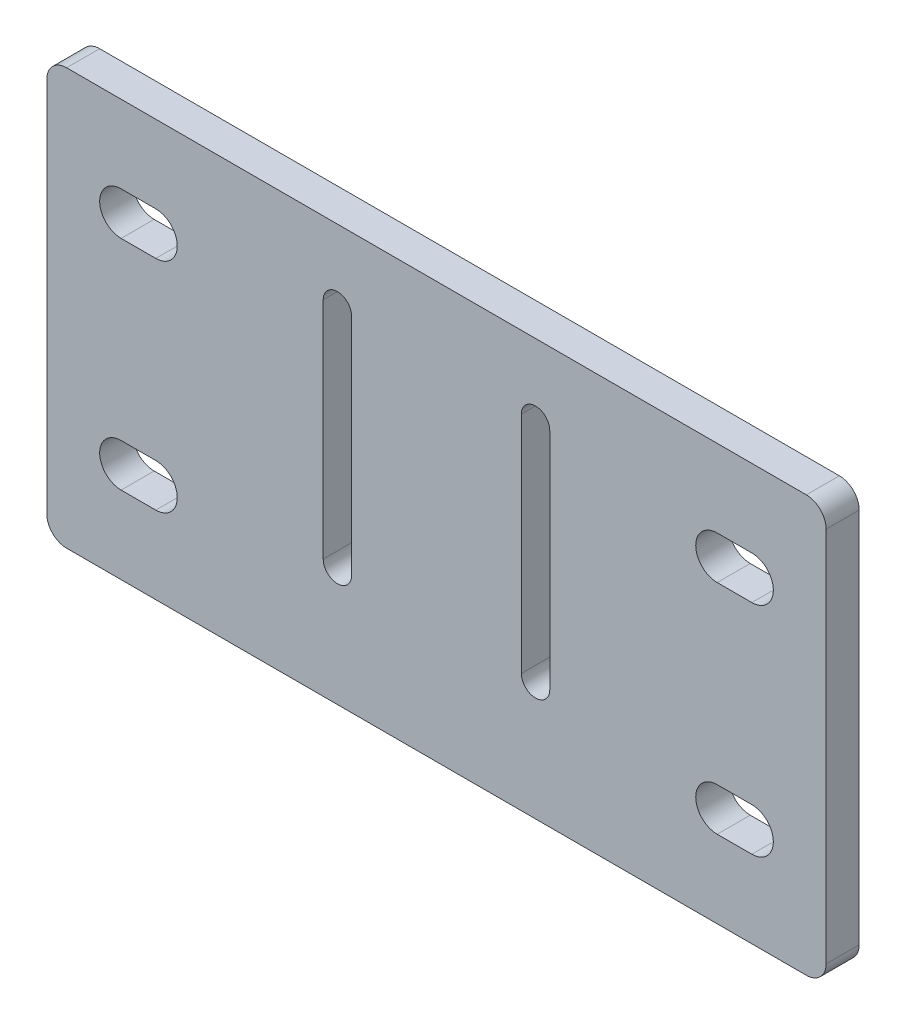
ISO-10303-21;
HEADER;
FILE_DESCRIPTION(('STEP AP214'),'2;1');
FILE_NAME('part.step','',(''),(''),'','','');
FILE_SCHEMA(('AUTOMOTIVE_DESIGN { 1 0 10303 214 1 1 1 1 }'));
ENDSEC;
DATA;
#1=APPLICATION_CONTEXT('core data for automotive mechanical design processes');
#2=APPLICATION_PROTOCOL_DEFINITION('international standard','automotive_design',2000,#1);
#3=PRODUCT_CONTEXT('',#1,'mechanical');
#4=PRODUCT('Part','Part','',(#3));
#5=PRODUCT_RELATED_PRODUCT_CATEGORY('part','',(#4));
#6=PRODUCT_DEFINITION_FORMATION('','',#4);
#7=PRODUCT_DEFINITION_CONTEXT('part definition',#1,'design');
#8=PRODUCT_DEFINITION('design','',#6,#7);
#9=PRODUCT_DEFINITION_SHAPE('','',#8);
#10=(LENGTH_UNIT() NAMED_UNIT(*) SI_UNIT(.MILLI.,.METRE.));
#11=(NAMED_UNIT(*) PLANE_ANGLE_UNIT() SI_UNIT($,.RADIAN.));
#12=(NAMED_UNIT(*) SI_UNIT($,.STERADIAN.) SOLID_ANGLE_UNIT());
#13=UNCERTAINTY_MEASURE_WITH_UNIT(LENGTH_MEASURE(1.E-05),#10,'distance_accuracy_value','');
#14=(GEOMETRIC_REPRESENTATION_CONTEXT(3) GLOBAL_UNCERTAINTY_ASSIGNED_CONTEXT((#13)) GLOBAL_UNIT_ASSIGNED_CONTEXT((#10,
#11,#12)) REPRESENTATION_CONTEXT('',''));
#15=CARTESIAN_POINT('',(0.,0.,0.));
#16=DIRECTION('',(0.,0.,1.));
#17=DIRECTION('',(1.,0.,0.));
#18=AXIS2_PLACEMENT_3D('',#15,#16,#17);
#19=CARTESIAN_POINT('',(56.,25.,5.));
#20=DIRECTION('',(0.,0.,1.));
#21=DIRECTION('',(1.,0.,0.));
#22=AXIS2_PLACEMENT_3D('',#19,#20,#21);
#23=PLANE('',#22);
#24=CARTESIAN_POINT('',(-47.7499999999999,-20.,5.));
#25=DIRECTION('',(0.,0.,1.));
#26=DIRECTION('',(-1.,0.,0.));
#27=AXIS2_PLACEMENT_3D('',#24,#25,#26);
#28=CIRCLE('',#27,3.25);
#29=CARTESIAN_POINT('',(-47.7499999999999,-16.75,5.));
#30=VERTEX_POINT('',#29);
#31=CARTESIAN_POINT('',(-47.7499999999999,-23.25,5.));
#32=VERTEX_POINT('',#31);
#33=EDGE_CURVE('E52',#30,#32,#28,.T.);
#34=ORIENTED_EDGE('',*,*,#33,.F.);
#35=DIRECTION('',(-1.,0.,0.));
#36=VECTOR('',#35,1.);
#37=CARTESIAN_POINT('',(-47.7499999999999,-16.75,5.));
#38=LINE('',#37,#36);
#39=CARTESIAN_POINT('',(-42.5,-16.75,5.));
#40=VERTEX_POINT('',#39);
#41=EDGE_CURVE('E269',#40,#30,#38,.T.);
#42=ORIENTED_EDGE('',*,*,#41,.F.);
#43=CARTESIAN_POINT('',(-42.5,-20.,5.));
#44=DIRECTION('',(0.,0.,1.));
#45=DIRECTION('',(-1.,0.,0.));
#46=AXIS2_PLACEMENT_3D('',#43,#44,#45);
#47=CIRCLE('',#46,3.25000000000001);
#48=CARTESIAN_POINT('',(-42.5,-23.25,5.));
#49=VERTEX_POINT('',#48);
#50=EDGE_CURVE('E253',#49,#40,#47,.T.);
#51=ORIENTED_EDGE('',*,*,#50,.F.);
#52=DIRECTION('',(1.,0.,0.));
#53=VECTOR('',#52,1.);
#54=CARTESIAN_POINT('',(-47.7499999999999,-23.25,5.));
#55=LINE('',#54,#53);
#56=EDGE_CURVE('E263',#32,#49,#55,.T.);
#57=ORIENTED_EDGE('',*,*,#56,.F.);
#58=EDGE_LOOP('',(#34,#42,#51,#57));
#59=FACE_BOUND('',#58,.T.);
#60=CARTESIAN_POINT('',(47.7499999999999,13.,5.));
#61=DIRECTION('',(0.,0.,1.));
#62=DIRECTION('',(-1.,0.,0.));
#63=AXIS2_PLACEMENT_3D('',#60,#61,#62);
#64=CIRCLE('',#63,3.25);
#65=CARTESIAN_POINT('',(47.7499999999999,9.74999999999999,5.));
#66=VERTEX_POINT('',#65);
#67=CARTESIAN_POINT('',(47.7499999999999,16.25,5.));
#68=VERTEX_POINT('',#67);
#69=EDGE_CURVE('E60',#66,#68,#64,.T.);
#70=ORIENTED_EDGE('',*,*,#69,.F.);
#71=DIRECTION('',(1.,0.,0.));
#72=VECTOR('',#71,1.);
#73=CARTESIAN_POINT('',(47.7499999999999,9.74999999999999,5.));
#74=LINE('',#73,#72);
#75=CARTESIAN_POINT('',(42.5,9.74999999999998,5.));
#76=VERTEX_POINT('',#75);
#77=EDGE_CURVE('E287',#76,#66,#74,.T.);
#78=ORIENTED_EDGE('',*,*,#77,.F.);
#79=CARTESIAN_POINT('',(42.5,13.,5.));
#80=DIRECTION('',(0.,0.,1.));
#81=DIRECTION('',(-1.,0.,0.));
#82=AXIS2_PLACEMENT_3D('',#79,#80,#81);
#83=CIRCLE('',#82,3.25000000000001);
#84=CARTESIAN_POINT('',(42.5,16.25,5.));
#85=VERTEX_POINT('',#84);
#86=EDGE_CURVE('E284',#85,#76,#83,.T.);
#87=ORIENTED_EDGE('',*,*,#86,.F.);
#88=DIRECTION('',(-1.,0.,0.));
#89=VECTOR('',#88,1.);
#90=CARTESIAN_POINT('',(47.7499999999999,16.25,5.));
#91=LINE('',#90,#89);
#92=EDGE_CURVE('E280',#68,#85,#91,.T.);
#93=ORIENTED_EDGE('',*,*,#92,.F.);
#94=EDGE_LOOP('',(#70,#78,#87,#93));
#95=FACE_BOUND('',#94,.T.);
#96=CARTESIAN_POINT('',(47.7499999999999,-20.,5.));
#97=DIRECTION('',(0.,0.,1.));
#98=DIRECTION('',(1.,0.,0.));
#99=AXIS2_PLACEMENT_3D('',#96,#97,#98);
#100=CIRCLE('',#99,3.25);
#101=CARTESIAN_POINT('',(47.7499999999999,-23.25,5.));
#102=VERTEX_POINT('',#101);
#103=CARTESIAN_POINT('',(47.7499999999999,-16.75,5.));
#104=VERTEX_POINT('',#103);
#105=EDGE_CURVE('E298',#102,#104,#100,.T.);
#106=ORIENTED_EDGE('',*,*,#105,.F.);
#107=DIRECTION('',(1.,0.,0.));
#108=VECTOR('',#107,1.);
#109=CARTESIAN_POINT('',(47.7499999999999,-23.25,5.));
#110=LINE('',#109,#108);
#111=CARTESIAN_POINT('',(42.5,-23.25,5.));
#112=VERTEX_POINT('',#111);
#113=EDGE_CURVE('E306',#112,#102,#110,.T.);
#114=ORIENTED_EDGE('',*,*,#113,.F.);
#115=CARTESIAN_POINT('',(42.5,-20.,5.));
#116=DIRECTION('',(0.,0.,1.));
#117=DIRECTION('',(1.,0.,0.));
#118=AXIS2_PLACEMENT_3D('',#115,#116,#117);
#119=CIRCLE('',#118,3.25000000000001);
#120=CARTESIAN_POINT('',(42.5,-16.75,5.));
#121=VERTEX_POINT('',#120);
#122=EDGE_CURVE('E303',#121,#112,#119,.T.);
#123=ORIENTED_EDGE('',*,*,#122,.F.);
#124=DIRECTION('',(-1.,0.,0.));
#125=VECTOR('',#124,1.);
#126=CARTESIAN_POINT('',(47.7499999999999,-16.75,5.));
#127=LINE('',#126,#125);
#128=EDGE_CURVE('E300',#104,#121,#127,.T.);
#129=ORIENTED_EDGE('',*,*,#128,.F.);
#130=EDGE_LOOP('',(#106,#114,#123,#129));
#131=FACE_BOUND('',#130,.T.);
#132=CARTESIAN_POINT('',(-47.7499999999999,13.,5.));
#133=DIRECTION('',(0.,0.,1.));
#134=DIRECTION('',(1.,0.,0.));
#135=AXIS2_PLACEMENT_3D('',#132,#133,#134);
#136=CIRCLE('',#135,3.25);
#137=CARTESIAN_POINT('',(-47.7499999999999,16.25,5.));
#138=VERTEX_POINT('',#137);
#139=CARTESIAN_POINT('',(-47.7499999999999,9.74999999999999,5.));
#140=VERTEX_POINT('',#139);
#141=EDGE_CURVE('E276',#138,#140,#136,.T.);
#142=ORIENTED_EDGE('',*,*,#141,.F.);
#143=DIRECTION('',(-1.,0.,0.));
#144=VECTOR('',#143,1.);
#145=CARTESIAN_POINT('',(-47.7499999999999,16.25,5.));
#146=LINE('',#145,#144);
#147=CARTESIAN_POINT('',(-42.5,16.25,5.));
#148=VERTEX_POINT('',#147);
#149=EDGE_CURVE('E324',#148,#138,#146,.T.);
#150=ORIENTED_EDGE('',*,*,#149,.F.);
#151=CARTESIAN_POINT('',(-42.5,13.,5.));
#152=DIRECTION('',(0.,0.,1.));
#153=DIRECTION('',(1.,0.,0.));
#154=AXIS2_PLACEMENT_3D('',#151,#152,#153);
#155=CIRCLE('',#154,3.25000000000001);
#156=CARTESIAN_POINT('',(-42.5,9.74999999999999,5.));
#157=VERTEX_POINT('',#156);
#158=EDGE_CURVE('E321',#157,#148,#155,.T.);
#159=ORIENTED_EDGE('',*,*,#158,.F.);
#160=DIRECTION('',(1.,0.,0.));
#161=VECTOR('',#160,1.);
#162=CARTESIAN_POINT('',(-47.7499999999999,9.74999999999999,5.));
#163=LINE('',#162,#161);
#164=EDGE_CURVE('E318',#140,#157,#163,.T.);
#165=ORIENTED_EDGE('',*,*,#164,.F.);
#166=EDGE_LOOP('',(#142,#150,#159,#165));
#167=FACE_BOUND('',#166,.T.);
#168=DIRECTION('',(0.,1.,0.));
#169=VECTOR('',#168,1.);
#170=CARTESIAN_POINT('',(59.,-32.,5.));
#171=LINE('',#170,#169);
#172=CARTESIAN_POINT('',(59.,-32.,5.));
#173=VERTEX_POINT('',#172);
#174=CARTESIAN_POINT('',(59.,25.,5.));
#175=VERTEX_POINT('',#174);
#176=EDGE_CURVE('E399',#173,#175,#171,.T.);
#177=ORIENTED_EDGE('',*,*,#176,.T.);
#178=CARTESIAN_POINT('',(56.,25.,5.));
#179=DIRECTION('',(0.,0.,1.));
#180=DIRECTION('',(1.,0.,0.));
#181=AXIS2_PLACEMENT_3D('',#178,#179,#180);
#182=CIRCLE('',#181,2.99999999999998);
#183=CARTESIAN_POINT('',(56.,28.,5.));
#184=VERTEX_POINT('',#183);
#185=EDGE_CURVE('E401',#175,#184,#182,.T.);
#186=ORIENTED_EDGE('',*,*,#185,.T.);
#187=DIRECTION('',(-1.,0.,0.));
#188=VECTOR('',#187,1.);
#189=CARTESIAN_POINT('',(56.,28.,5.));
#190=LINE('',#189,#188);
#191=CARTESIAN_POINT('',(-56.,28.,5.));
#192=VERTEX_POINT('',#191);
#193=EDGE_CURVE('E404',#184,#192,#190,.T.);
#194=ORIENTED_EDGE('',*,*,#193,.T.);
#195=CARTESIAN_POINT('',(-56.,25.,5.));
#196=DIRECTION('',(0.,0.,1.));
#197=DIRECTION('',(1.,0.,0.));
#198=AXIS2_PLACEMENT_3D('',#195,#196,#197);
#199=CIRCLE('',#198,3.);
#200=CARTESIAN_POINT('',(-59.,25.,5.));
#201=VERTEX_POINT('',#200);
#202=EDGE_CURVE('E406',#192,#201,#199,.T.);
#203=ORIENTED_EDGE('',*,*,#202,.T.);
#204=DIRECTION('',(0.,-1.,0.));
#205=VECTOR('',#204,1.);
#206=CARTESIAN_POINT('',(-59.,-25.,5.));
#207=LINE('',#206,#205);
#208=CARTESIAN_POINT('',(-59.,-32.,5.));
#209=VERTEX_POINT('',#208);
#210=EDGE_CURVE('E408',#201,#209,#207,.T.);
#211=ORIENTED_EDGE('',*,*,#210,.T.);
#212=CARTESIAN_POINT('',(-56.,-32.,5.));
#213=DIRECTION('',(0.,0.,1.));
#214=DIRECTION('',(1.,0.,0.));
#215=AXIS2_PLACEMENT_3D('',#212,#213,#214);
#216=CIRCLE('',#215,2.99999999999999);
#217=CARTESIAN_POINT('',(-56.,-35.,5.));
#218=VERTEX_POINT('',#217);
#219=EDGE_CURVE('E410',#209,#218,#216,.T.);
#220=ORIENTED_EDGE('',*,*,#219,.T.);
#221=DIRECTION('',(1.,0.,0.));
#222=VECTOR('',#221,1.);
#223=CARTESIAN_POINT('',(-56.,-35.,5.));
#224=LINE('',#223,#222);
#225=CARTESIAN_POINT('',(56.,-35.,5.));
#226=VERTEX_POINT('',#225);
#227=EDGE_CURVE('E412',#218,#226,#224,.T.);
#228=ORIENTED_EDGE('',*,*,#227,.T.);
#229=CARTESIAN_POINT('',(56.,-32.,5.));
#230=DIRECTION('',(0.,0.,1.));
#231=DIRECTION('',(1.,0.,0.));
#232=AXIS2_PLACEMENT_3D('',#229,#230,#231);
#233=CIRCLE('',#232,2.99999999999999);
#234=EDGE_CURVE('E414',#226,#173,#233,.T.);
#235=ORIENTED_EDGE('',*,*,#234,.T.);
#236=EDGE_LOOP('',(#177,#186,#194,#203,#211,#220,#228,#235));
#237=FACE_BOUND('',#236,.T.);
#238=DIRECTION('',(0.,1.,0.));
#239=VECTOR('',#238,1.);
#240=CARTESIAN_POINT('',(17.15,-17.,5.));
#241=LINE('',#240,#239);
#242=CARTESIAN_POINT('',(17.15,-17.,5.));
#243=VERTEX_POINT('',#242);
#244=CARTESIAN_POINT('',(17.15,17.,5.));
#245=VERTEX_POINT('',#244);
#246=EDGE_CURVE('E370',#243,#245,#241,.T.);
#247=ORIENTED_EDGE('',*,*,#246,.F.);
#248=CARTESIAN_POINT('',(15.,-17.,5.));
#249=DIRECTION('',(0.,0.,1.));
#250=DIRECTION('',(1.,0.,0.));
#251=AXIS2_PLACEMENT_3D('',#248,#249,#250);
#252=CIRCLE('',#251,2.15);
#253=CARTESIAN_POINT('',(12.85,-17.,5.));
#254=VERTEX_POINT('',#253);
#255=EDGE_CURVE('E368',#254,#243,#252,.T.);
#256=ORIENTED_EDGE('',*,*,#255,.F.);
#257=DIRECTION('',(0.,-1.,0.));
#258=VECTOR('',#257,1.);
#259=CARTESIAN_POINT('',(12.85,-17.,5.));
#260=LINE('',#259,#258);
#261=CARTESIAN_POINT('',(12.85,17.,5.));
#262=VERTEX_POINT('',#261);
#263=EDGE_CURVE('E376',#262,#254,#260,.T.);
#264=ORIENTED_EDGE('',*,*,#263,.F.);
#265=CARTESIAN_POINT('',(15.,17.,5.));
#266=DIRECTION('',(0.,0.,1.));
#267=DIRECTION('',(1.,0.,0.));
#268=AXIS2_PLACEMENT_3D('',#265,#266,#267);
#269=CIRCLE('',#268,2.15);
#270=EDGE_CURVE('E373',#245,#262,#269,.T.);
#271=ORIENTED_EDGE('',*,*,#270,.F.);
#272=EDGE_LOOP('',(#247,#256,#264,#271));
#273=FACE_BOUND('',#272,.T.);
#274=DIRECTION('',(0.,1.,0.));
#275=VECTOR('',#274,1.);
#276=CARTESIAN_POINT('',(-12.85,-17.,5.));
#277=LINE('',#276,#275);
#278=CARTESIAN_POINT('',(-12.85,-17.,5.));
#279=VERTEX_POINT('',#278);
#280=CARTESIAN_POINT('',(-12.85,17.,5.));
#281=VERTEX_POINT('',#280);
#282=EDGE_CURVE('E339',#279,#281,#277,.T.);
#283=ORIENTED_EDGE('',*,*,#282,.F.);
#284=CARTESIAN_POINT('',(-15.,-17.,5.));
#285=DIRECTION('',(0.,0.,1.));
#286=DIRECTION('',(-1.,0.,0.));
#287=AXIS2_PLACEMENT_3D('',#284,#285,#286);
#288=CIRCLE('',#287,2.15);
#289=CARTESIAN_POINT('',(-17.15,-17.,5.));
#290=VERTEX_POINT('',#289);
#291=EDGE_CURVE('E337',#290,#279,#288,.T.);
#292=ORIENTED_EDGE('',*,*,#291,.F.);
#293=DIRECTION('',(0.,-1.,0.));
#294=VECTOR('',#293,1.);
#295=CARTESIAN_POINT('',(-17.15,-17.,5.));
#296=LINE('',#295,#294);
#297=CARTESIAN_POINT('',(-17.15,17.,5.));
#298=VERTEX_POINT('',#297);
#299=EDGE_CURVE('E345',#298,#290,#296,.T.);
#300=ORIENTED_EDGE('',*,*,#299,.F.);
#301=CARTESIAN_POINT('',(-15.,17.,5.));
#302=DIRECTION('',(0.,0.,1.));
#303=DIRECTION('',(-1.,0.,0.));
#304=AXIS2_PLACEMENT_3D('',#301,#302,#303);
#305=CIRCLE('',#304,2.15);
#306=EDGE_CURVE('E342',#281,#298,#305,.T.);
#307=ORIENTED_EDGE('',*,*,#306,.F.);
#308=EDGE_LOOP('',(#283,#292,#300,#307));
#309=FACE_BOUND('',#308,.T.);
#310=ADVANCED_FACE('F37',(#59,#95,#131,#167,#237,#273,#309),#23,.T.);
#311=CARTESIAN_POINT('',(56.,25.,0.));
#312=DIRECTION('',(0.,0.,1.));
#313=DIRECTION('',(1.,0.,0.));
#314=AXIS2_PLACEMENT_3D('',#311,#312,#313);
#315=PLANE('',#314);
#316=DIRECTION('',(-1.,0.,0.));
#317=VECTOR('',#316,1.);
#318=CARTESIAN_POINT('',(56.,-16.7499999999999,0.));
#319=LINE('',#318,#317);
#320=CARTESIAN_POINT('',(-42.5,-16.75,0.));
#321=VERTEX_POINT('',#320);
#322=CARTESIAN_POINT('',(-47.7499999999999,-16.75,0.));
#323=VERTEX_POINT('',#322);
#324=EDGE_CURVE('E45',#321,#323,#319,.T.);
#325=ORIENTED_EDGE('',*,*,#324,.T.);
#326=CARTESIAN_POINT('',(-47.7499999999999,-20.,0.));
#327=DIRECTION('',(0.,0.,1.));
#328=DIRECTION('',(1.,0.,0.));
#329=AXIS2_PLACEMENT_3D('',#326,#327,#328);
#330=CIRCLE('',#329,3.25);
#331=CARTESIAN_POINT('',(-47.7499999999999,-23.25,0.));
#332=VERTEX_POINT('',#331);
#333=EDGE_CURVE('E11',#323,#332,#330,.T.);
#334=ORIENTED_EDGE('',*,*,#333,.T.);
#335=DIRECTION('',(1.,0.,0.));
#336=VECTOR('',#335,1.);
#337=CARTESIAN_POINT('',(56.,-23.2500000000001,0.));
#338=LINE('',#337,#336);
#339=CARTESIAN_POINT('',(-42.5,-23.25,0.));
#340=VERTEX_POINT('',#339);
#341=EDGE_CURVE('E492',#332,#340,#338,.T.);
#342=ORIENTED_EDGE('',*,*,#341,.T.);
#343=CARTESIAN_POINT('',(-42.5,-20.,0.));
#344=DIRECTION('',(0.,0.,1.));
#345=DIRECTION('',(1.,0.,0.));
#346=AXIS2_PLACEMENT_3D('',#343,#344,#345);
#347=CIRCLE('',#346,3.25000000000001);
#348=EDGE_CURVE('E256',#340,#321,#347,.T.);
#349=ORIENTED_EDGE('',*,*,#348,.T.);
#350=EDGE_LOOP('',(#325,#334,#342,#349));
#351=FACE_BOUND('',#350,.T.);
#352=DIRECTION('',(1.,0.,0.));
#353=VECTOR('',#352,1.);
#354=CARTESIAN_POINT('',(56.,9.75,0.));
#355=LINE('',#354,#353);
#356=CARTESIAN_POINT('',(42.5,9.74999999999998,0.));
#357=VERTEX_POINT('',#356);
#358=CARTESIAN_POINT('',(47.7499999999999,9.74999999999999,0.));
#359=VERTEX_POINT('',#358);
#360=EDGE_CURVE('E486',#357,#359,#355,.T.);
#361=ORIENTED_EDGE('',*,*,#360,.T.);
#362=CARTESIAN_POINT('',(47.7499999999999,13.,0.));
#363=DIRECTION('',(0.,0.,1.));
#364=DIRECTION('',(1.,0.,0.));
#365=AXIS2_PLACEMENT_3D('',#362,#363,#364);
#366=CIRCLE('',#365,3.25);
#367=CARTESIAN_POINT('',(47.7499999999999,16.25,0.));
#368=VERTEX_POINT('',#367);
#369=EDGE_CURVE('E489',#359,#368,#366,.T.);
#370=ORIENTED_EDGE('',*,*,#369,.T.);
#371=DIRECTION('',(-1.,0.,0.));
#372=VECTOR('',#371,1.);
#373=CARTESIAN_POINT('',(56.,16.25,0.));
#374=LINE('',#373,#372);
#375=CARTESIAN_POINT('',(42.5,16.25,0.));
#376=VERTEX_POINT('',#375);
#377=EDGE_CURVE('E480',#368,#376,#374,.T.);
#378=ORIENTED_EDGE('',*,*,#377,.T.);
#379=CARTESIAN_POINT('',(42.5,13.,0.));
#380=DIRECTION('',(0.,0.,1.));
#381=DIRECTION('',(1.,0.,0.));
#382=AXIS2_PLACEMENT_3D('',#379,#380,#381);
#383=CIRCLE('',#382,3.25000000000001);
#384=EDGE_CURVE('E483',#376,#357,#383,.T.);
#385=ORIENTED_EDGE('',*,*,#384,.T.);
#386=EDGE_LOOP('',(#361,#370,#378,#385));
#387=FACE_BOUND('',#386,.T.);
#388=DIRECTION('',(1.,0.,0.));
#389=VECTOR('',#388,1.);
#390=CARTESIAN_POINT('',(56.,-23.25,0.));
#391=LINE('',#390,#389);
#392=CARTESIAN_POINT('',(42.5,-23.25,0.));
#393=VERTEX_POINT('',#392);
#394=CARTESIAN_POINT('',(47.7499999999999,-23.25,0.));
#395=VERTEX_POINT('',#394);
#396=EDGE_CURVE('E474',#393,#395,#391,.T.);
#397=ORIENTED_EDGE('',*,*,#396,.T.);
#398=CARTESIAN_POINT('',(47.7499999999999,-20.,0.));
#399=DIRECTION('',(0.,0.,1.));
#400=DIRECTION('',(1.,0.,0.));
#401=AXIS2_PLACEMENT_3D('',#398,#399,#400);
#402=CIRCLE('',#401,3.25);
#403=CARTESIAN_POINT('',(47.7499999999999,-16.75,0.));
#404=VERTEX_POINT('',#403);
#405=EDGE_CURVE('E477',#395,#404,#402,.T.);
#406=ORIENTED_EDGE('',*,*,#405,.T.);
#407=DIRECTION('',(-1.,0.,0.));
#408=VECTOR('',#407,1.);
#409=CARTESIAN_POINT('',(56.,-16.75,0.));
#410=LINE('',#409,#408);
#411=CARTESIAN_POINT('',(42.5,-16.75,0.));
#412=VERTEX_POINT('',#411);
#413=EDGE_CURVE('E468',#404,#412,#410,.T.);
#414=ORIENTED_EDGE('',*,*,#413,.T.);
#415=CARTESIAN_POINT('',(42.5,-20.,0.));
#416=DIRECTION('',(0.,0.,1.));
#417=DIRECTION('',(1.,0.,0.));
#418=AXIS2_PLACEMENT_3D('',#415,#416,#417);
#419=CIRCLE('',#418,3.25000000000001);
#420=EDGE_CURVE('E471',#412,#393,#419,.T.);
#421=ORIENTED_EDGE('',*,*,#420,.T.);
#422=EDGE_LOOP('',(#397,#406,#414,#421));
#423=FACE_BOUND('',#422,.T.);
#424=DIRECTION('',(-1.,0.,0.));
#425=VECTOR('',#424,1.);
#426=CARTESIAN_POINT('',(56.,16.2500000000001,0.));
#427=LINE('',#426,#425);
#428=CARTESIAN_POINT('',(-42.5,16.25,0.));
#429=VERTEX_POINT('',#428);
#430=CARTESIAN_POINT('',(-47.7499999999999,16.25,0.));
#431=VERTEX_POINT('',#430);
#432=EDGE_CURVE('E462',#429,#431,#427,.T.);
#433=ORIENTED_EDGE('',*,*,#432,.T.);
#434=CARTESIAN_POINT('',(-47.7499999999999,13.,0.));
#435=DIRECTION('',(0.,0.,1.));
#436=DIRECTION('',(1.,0.,0.));
#437=AXIS2_PLACEMENT_3D('',#434,#435,#436);
#438=CIRCLE('',#437,3.25);
#439=CARTESIAN_POINT('',(-47.7499999999999,9.74999999999999,0.));
#440=VERTEX_POINT('',#439);
#441=EDGE_CURVE('E465',#431,#440,#438,.T.);
#442=ORIENTED_EDGE('',*,*,#441,.T.);
#443=DIRECTION('',(1.,0.,0.));
#444=VECTOR('',#443,1.);
#445=CARTESIAN_POINT('',(56.,9.74999999999993,0.));
#446=LINE('',#445,#444);
#447=CARTESIAN_POINT('',(-42.5,9.74999999999999,0.));
#448=VERTEX_POINT('',#447);
#449=EDGE_CURVE('E456',#440,#448,#446,.T.);
#450=ORIENTED_EDGE('',*,*,#449,.T.);
#451=CARTESIAN_POINT('',(-42.5,13.,0.));
#452=DIRECTION('',(0.,0.,1.));
#453=DIRECTION('',(1.,0.,0.));
#454=AXIS2_PLACEMENT_3D('',#451,#452,#453);
#455=CIRCLE('',#454,3.25000000000001);
#456=EDGE_CURVE('E459',#448,#429,#455,.T.);
#457=ORIENTED_EDGE('',*,*,#456,.T.);
#458=EDGE_LOOP('',(#433,#442,#450,#457));
#459=FACE_BOUND('',#458,.T.);
#460=CARTESIAN_POINT('',(15.,-17.,0.));
#461=DIRECTION('',(0.,0.,1.));
#462=DIRECTION('',(1.,0.,0.));
#463=AXIS2_PLACEMENT_3D('',#460,#461,#462);
#464=CIRCLE('',#463,2.15);
#465=CARTESIAN_POINT('',(12.85,-17.,0.));
#466=VERTEX_POINT('',#465);
#467=CARTESIAN_POINT('',(17.15,-17.,0.));
#468=VERTEX_POINT('',#467);
#469=EDGE_CURVE('E367',#466,#468,#464,.T.);
#470=ORIENTED_EDGE('',*,*,#469,.T.);
#471=DIRECTION('',(0.,1.,0.));
#472=VECTOR('',#471,1.);
#473=CARTESIAN_POINT('',(17.15,-17.,0.));
#474=LINE('',#473,#472);
#475=CARTESIAN_POINT('',(17.15,17.,0.));
#476=VERTEX_POINT('',#475);
#477=EDGE_CURVE('E381',#468,#476,#474,.T.);
#478=ORIENTED_EDGE('',*,*,#477,.T.);
#479=CARTESIAN_POINT('',(15.,17.,0.));
#480=DIRECTION('',(0.,0.,1.));
#481=DIRECTION('',(1.,0.,0.));
#482=AXIS2_PLACEMENT_3D('',#479,#480,#481);
#483=CIRCLE('',#482,2.15);
#484=CARTESIAN_POINT('',(12.85,17.,0.));
#485=VERTEX_POINT('',#484);
#486=EDGE_CURVE('E384',#476,#485,#483,.T.);
#487=ORIENTED_EDGE('',*,*,#486,.T.);
#488=DIRECTION('',(0.,-1.,0.));
#489=VECTOR('',#488,1.);
#490=CARTESIAN_POINT('',(12.85,-17.,0.));
#491=LINE('',#490,#489);
#492=EDGE_CURVE('E371',#485,#466,#491,.T.);
#493=ORIENTED_EDGE('',*,*,#492,.T.);
#494=EDGE_LOOP('',(#470,#478,#487,#493));
#495=FACE_BOUND('',#494,.T.);
#496=DIRECTION('',(0.,1.,0.));
#497=VECTOR('',#496,1.);
#498=CARTESIAN_POINT('',(59.,-25.,0.));
#499=LINE('',#498,#497);
#500=CARTESIAN_POINT('',(59.,-32.,0.));
#501=VERTEX_POINT('',#500);
#502=CARTESIAN_POINT('',(59.,25.,0.));
#503=VERTEX_POINT('',#502);
#504=EDGE_CURVE('E398',#501,#503,#499,.T.);
#505=ORIENTED_EDGE('',*,*,#504,.F.);
#506=CARTESIAN_POINT('',(56.,-32.,0.));
#507=DIRECTION('',(0.,0.,1.));
#508=DIRECTION('',(1.,0.,0.));
#509=AXIS2_PLACEMENT_3D('',#506,#507,#508);
#510=CIRCLE('',#509,2.99999999999999);
#511=CARTESIAN_POINT('',(56.,-35.,0.));
#512=VERTEX_POINT('',#511);
#513=EDGE_CURVE('E402',#512,#501,#510,.T.);
#514=ORIENTED_EDGE('',*,*,#513,.F.);
#515=DIRECTION('',(1.,0.,0.));
#516=VECTOR('',#515,1.);
#517=CARTESIAN_POINT('',(-56.,-35.,0.));
#518=LINE('',#517,#516);
#519=CARTESIAN_POINT('',(-56.,-35.,0.));
#520=VERTEX_POINT('',#519);
#521=EDGE_CURVE('E429',#520,#512,#518,.T.);
#522=ORIENTED_EDGE('',*,*,#521,.F.);
#523=CARTESIAN_POINT('',(-56.,-32.,0.));
#524=DIRECTION('',(0.,0.,1.));
#525=DIRECTION('',(1.,0.,0.));
#526=AXIS2_PLACEMENT_3D('',#523,#524,#525);
#527=CIRCLE('',#526,2.99999999999999);
#528=CARTESIAN_POINT('',(-59.,-32.,0.));
#529=VERTEX_POINT('',#528);
#530=EDGE_CURVE('E427',#529,#520,#527,.T.);
#531=ORIENTED_EDGE('',*,*,#530,.F.);
#532=DIRECTION('',(0.,-1.,0.));
#533=VECTOR('',#532,1.);
#534=CARTESIAN_POINT('',(-59.,-25.,0.));
#535=LINE('',#534,#533);
#536=CARTESIAN_POINT('',(-59.,25.,0.));
#537=VERTEX_POINT('',#536);
#538=EDGE_CURVE('E425',#537,#529,#535,.T.);
#539=ORIENTED_EDGE('',*,*,#538,.F.);
#540=CARTESIAN_POINT('',(-56.,25.,0.));
#541=DIRECTION('',(0.,0.,1.));
#542=DIRECTION('',(1.,0.,0.));
#543=AXIS2_PLACEMENT_3D('',#540,#541,#542);
#544=CIRCLE('',#543,3.);
#545=CARTESIAN_POINT('',(-56.,28.,0.));
#546=VERTEX_POINT('',#545);
#547=EDGE_CURVE('E422',#546,#537,#544,.T.);
#548=ORIENTED_EDGE('',*,*,#547,.F.);
#549=DIRECTION('',(-1.,0.,0.));
#550=VECTOR('',#549,1.);
#551=CARTESIAN_POINT('',(56.,28.,0.));
#552=LINE('',#551,#550);
#553=CARTESIAN_POINT('',(56.,28.,0.));
#554=VERTEX_POINT('',#553);
#555=EDGE_CURVE('E420',#554,#546,#552,.T.);
#556=ORIENTED_EDGE('',*,*,#555,.F.);
#557=CARTESIAN_POINT('',(56.,25.,0.));
#558=DIRECTION('',(0.,0.,1.));
#559=DIRECTION('',(1.,0.,0.));
#560=AXIS2_PLACEMENT_3D('',#557,#558,#559);
#561=CIRCLE('',#560,2.99999999999998);
#562=EDGE_CURVE('E418',#503,#554,#561,.T.);
#563=ORIENTED_EDGE('',*,*,#562,.F.);
#564=EDGE_LOOP('',(#505,#514,#522,#531,#539,#548,#556,#563));
#565=FACE_BOUND('',#564,.T.);
#566=CARTESIAN_POINT('',(-15.,-17.,0.));
#567=DIRECTION('',(0.,0.,1.));
#568=DIRECTION('',(-1.,0.,0.));
#569=AXIS2_PLACEMENT_3D('',#566,#567,#568);
#570=CIRCLE('',#569,2.15);
#571=CARTESIAN_POINT('',(-17.15,-17.,0.));
#572=VERTEX_POINT('',#571);
#573=CARTESIAN_POINT('',(-12.85,-17.,0.));
#574=VERTEX_POINT('',#573);
#575=EDGE_CURVE('E330',#572,#574,#570,.T.);
#576=ORIENTED_EDGE('',*,*,#575,.T.);
#577=DIRECTION('',(0.,1.,0.));
#578=VECTOR('',#577,1.);
#579=CARTESIAN_POINT('',(-12.85,-17.,0.));
#580=LINE('',#579,#578);
#581=CARTESIAN_POINT('',(-12.85,17.,0.));
#582=VERTEX_POINT('',#581);
#583=EDGE_CURVE('E350',#574,#582,#580,.T.);
#584=ORIENTED_EDGE('',*,*,#583,.T.);
#585=CARTESIAN_POINT('',(-15.,17.,0.));
#586=DIRECTION('',(0.,0.,1.));
#587=DIRECTION('',(-1.,0.,0.));
#588=AXIS2_PLACEMENT_3D('',#585,#586,#587);
#589=CIRCLE('',#588,2.15);
#590=CARTESIAN_POINT('',(-17.15,17.,0.));
#591=VERTEX_POINT('',#590);
#592=EDGE_CURVE('E353',#582,#591,#589,.T.);
#593=ORIENTED_EDGE('',*,*,#592,.T.);
#594=DIRECTION('',(0.,-1.,0.));
#595=VECTOR('',#594,1.);
#596=CARTESIAN_POINT('',(-17.15,-17.,0.));
#597=LINE('',#596,#595);
#598=EDGE_CURVE('E340',#591,#572,#597,.T.);
#599=ORIENTED_EDGE('',*,*,#598,.T.);
#600=EDGE_LOOP('',(#576,#584,#593,#599));
#601=FACE_BOUND('',#600,.T.);
#602=ADVANCED_FACE('F496',(#351,#387,#423,#459,#495,#565,#601),#315,.F.);
#603=CARTESIAN_POINT('',(59.,-25.,5.));
#604=DIRECTION('',(-1.,0.,0.));
#605=DIRECTION('',(0.,-1.,0.));
#606=AXIS2_PLACEMENT_3D('',#603,#604,#605);
#607=PLANE('',#606);
#608=ORIENTED_EDGE('',*,*,#504,.T.);
#609=DIRECTION('',(0.,0.,-1.));
#610=VECTOR('',#609,1.);
#611=CARTESIAN_POINT('',(59.,25.,5.));
#612=LINE('',#611,#610);
#613=EDGE_CURVE('E453',#175,#503,#612,.T.);
#614=ORIENTED_EDGE('',*,*,#613,.F.);
#615=ORIENTED_EDGE('',*,*,#176,.F.);
#616=DIRECTION('',(0.,0.,-1.));
#617=VECTOR('',#616,1.);
#618=CARTESIAN_POINT('',(59.,-32.,5.));
#619=LINE('',#618,#617);
#620=EDGE_CURVE('E416',#173,#501,#619,.T.);
#621=ORIENTED_EDGE('',*,*,#620,.T.);
#622=EDGE_LOOP('',(#608,#614,#615,#621));
#623=FACE_BOUND('',#622,.T.);
#624=ADVANCED_FACE('F39',(#623),#607,.F.);
#625=CARTESIAN_POINT('',(56.,25.,5.));
#626=DIRECTION('',(0.,0.,-1.));
#627=DIRECTION('',(-1.,0.,0.));
#628=AXIS2_PLACEMENT_3D('',#625,#626,#627);
#629=CYLINDRICAL_SURFACE('',#628,2.99999999999998);
#630=ORIENTED_EDGE('',*,*,#562,.T.);
#631=DIRECTION('',(0.,0.,-1.));
#632=VECTOR('',#631,1.);
#633=CARTESIAN_POINT('',(56.,28.,5.));
#634=LINE('',#633,#632);
#635=EDGE_CURVE('E450',#184,#554,#634,.T.);
#636=ORIENTED_EDGE('',*,*,#635,.F.);
#637=ORIENTED_EDGE('',*,*,#185,.F.);
#638=ORIENTED_EDGE('',*,*,#613,.T.);
#639=EDGE_LOOP('',(#630,#636,#637,#638));
#640=FACE_BOUND('',#639,.T.);
#641=ADVANCED_FACE('F548',(#640),#629,.T.);
#642=CARTESIAN_POINT('',(56.,28.,5.));
#643=DIRECTION('',(0.,-1.,0.));
#644=DIRECTION('',(1.,0.,0.));
#645=AXIS2_PLACEMENT_3D('',#642,#643,#644);
#646=PLANE('',#645);
#647=ORIENTED_EDGE('',*,*,#555,.T.);
#648=DIRECTION('',(0.,0.,-1.));
#649=VECTOR('',#648,1.);
#650=CARTESIAN_POINT('',(-56.,28.,5.));
#651=LINE('',#650,#649);
#652=EDGE_CURVE('E447',#192,#546,#651,.T.);
#653=ORIENTED_EDGE('',*,*,#652,.F.);
#654=ORIENTED_EDGE('',*,*,#193,.F.);
#655=ORIENTED_EDGE('',*,*,#635,.T.);
#656=EDGE_LOOP('',(#647,#653,#654,#655));
#657=FACE_BOUND('',#656,.T.);
#658=ADVANCED_FACE('F545',(#657),#646,.F.);
#659=CARTESIAN_POINT('',(-56.,25.,5.));
#660=DIRECTION('',(0.,0.,-1.));
#661=DIRECTION('',(-1.,0.,0.));
#662=AXIS2_PLACEMENT_3D('',#659,#660,#661);
#663=CYLINDRICAL_SURFACE('',#662,3.);
#664=ORIENTED_EDGE('',*,*,#547,.T.);
#665=DIRECTION('',(0.,0.,-1.));
#666=VECTOR('',#665,1.);
#667=CARTESIAN_POINT('',(-59.,25.,5.));
#668=LINE('',#667,#666);
#669=EDGE_CURVE('E444',#201,#537,#668,.T.);
#670=ORIENTED_EDGE('',*,*,#669,.F.);
#671=ORIENTED_EDGE('',*,*,#202,.F.);
#672=ORIENTED_EDGE('',*,*,#652,.T.);
#673=EDGE_LOOP('',(#664,#670,#671,#672));
#674=FACE_BOUND('',#673,.T.);
#675=ADVANCED_FACE('F541',(#674),#663,.T.);
#676=CARTESIAN_POINT('',(-59.,-25.,5.));
#677=DIRECTION('',(1.,0.,0.));
#678=DIRECTION('',(0.,0.,-1.));
#679=AXIS2_PLACEMENT_3D('',#676,#677,#678);
#680=PLANE('',#679);
#681=ORIENTED_EDGE('',*,*,#538,.T.);
#682=DIRECTION('',(0.,0.,-1.));
#683=VECTOR('',#682,1.);
#684=CARTESIAN_POINT('',(-59.,-32.,5.));
#685=LINE('',#684,#683);
#686=EDGE_CURVE('E441',#209,#529,#685,.T.);
#687=ORIENTED_EDGE('',*,*,#686,.F.);
#688=ORIENTED_EDGE('',*,*,#210,.F.);
#689=ORIENTED_EDGE('',*,*,#669,.T.);
#690=EDGE_LOOP('',(#681,#687,#688,#689));
#691=FACE_BOUND('',#690,.T.);
#692=ADVANCED_FACE('F537',(#691),#680,.F.);
#693=CARTESIAN_POINT('',(-56.,-32.,5.));
#694=DIRECTION('',(0.,0.,-1.));
#695=DIRECTION('',(-1.,0.,0.));
#696=AXIS2_PLACEMENT_3D('',#693,#694,#695);
#697=CYLINDRICAL_SURFACE('',#696,2.99999999999999);
#698=ORIENTED_EDGE('',*,*,#530,.T.);
#699=DIRECTION('',(0.,0.,-1.));
#700=VECTOR('',#699,1.);
#701=CARTESIAN_POINT('',(-56.,-35.,5.));
#702=LINE('',#701,#700);
#703=EDGE_CURVE('E438',#218,#520,#702,.T.);
#704=ORIENTED_EDGE('',*,*,#703,.F.);
#705=ORIENTED_EDGE('',*,*,#219,.F.);
#706=ORIENTED_EDGE('',*,*,#686,.T.);
#707=EDGE_LOOP('',(#698,#704,#705,#706));
#708=FACE_BOUND('',#707,.T.);
#709=ADVANCED_FACE('F533',(#708),#697,.T.);
#710=CARTESIAN_POINT('',(-56.,-35.,5.));
#711=DIRECTION('',(0.,1.,0.));
#712=DIRECTION('',(-1.,0.,0.));
#713=AXIS2_PLACEMENT_3D('',#710,#711,#712);
#714=PLANE('',#713);
#715=ORIENTED_EDGE('',*,*,#521,.T.);
#716=DIRECTION('',(0.,0.,-1.));
#717=VECTOR('',#716,1.);
#718=CARTESIAN_POINT('',(56.,-35.,5.));
#719=LINE('',#718,#717);
#720=EDGE_CURVE('E435',#226,#512,#719,.T.);
#721=ORIENTED_EDGE('',*,*,#720,.F.);
#722=ORIENTED_EDGE('',*,*,#227,.F.);
#723=ORIENTED_EDGE('',*,*,#703,.T.);
#724=EDGE_LOOP('',(#715,#721,#722,#723));
#725=FACE_BOUND('',#724,.T.);
#726=ADVANCED_FACE('F529',(#725),#714,.F.);
#727=CARTESIAN_POINT('',(56.,-32.,5.));
#728=DIRECTION('',(0.,0.,-1.));
#729=DIRECTION('',(-1.,0.,0.));
#730=AXIS2_PLACEMENT_3D('',#727,#728,#729);
#731=CYLINDRICAL_SURFACE('',#730,2.99999999999999);
#732=ORIENTED_EDGE('',*,*,#513,.T.);
#733=ORIENTED_EDGE('',*,*,#620,.F.);
#734=ORIENTED_EDGE('',*,*,#234,.F.);
#735=ORIENTED_EDGE('',*,*,#720,.T.);
#736=EDGE_LOOP('',(#732,#733,#734,#735));
#737=FACE_BOUND('',#736,.T.);
#738=ADVANCED_FACE('F526',(#737),#731,.T.);
#739=CARTESIAN_POINT('',(15.,-17.,5.));
#740=DIRECTION('',(0.,0.,-1.));
#741=DIRECTION('',(-1.,0.,0.));
#742=AXIS2_PLACEMENT_3D('',#739,#740,#741);
#743=CYLINDRICAL_SURFACE('',#742,2.15);
#744=ORIENTED_EDGE('',*,*,#469,.F.);
#745=DIRECTION('',(0.,0.,-1.));
#746=VECTOR('',#745,1.);
#747=CARTESIAN_POINT('',(12.85,-17.,5.));
#748=LINE('',#747,#746);
#749=EDGE_CURVE('E378',#254,#466,#748,.T.);
#750=ORIENTED_EDGE('',*,*,#749,.F.);
#751=ORIENTED_EDGE('',*,*,#255,.T.);
#752=DIRECTION('',(0.,0.,-1.));
#753=VECTOR('',#752,1.);
#754=CARTESIAN_POINT('',(17.15,-17.,5.));
#755=LINE('',#754,#753);
#756=EDGE_CURVE('E395',#243,#468,#755,.T.);
#757=ORIENTED_EDGE('',*,*,#756,.T.);
#758=EDGE_LOOP('',(#744,#750,#751,#757));
#759=FACE_BOUND('',#758,.T.);
#760=ADVANCED_FACE('F523',(#759),#743,.F.);
#761=CARTESIAN_POINT('',(17.15,-17.,5.));
#762=DIRECTION('',(-1.,0.,0.));
#763=DIRECTION('',(0.,-1.,0.));
#764=AXIS2_PLACEMENT_3D('',#761,#762,#763);
#765=PLANE('',#764);
#766=ORIENTED_EDGE('',*,*,#477,.F.);
#767=ORIENTED_EDGE('',*,*,#756,.F.);
#768=ORIENTED_EDGE('',*,*,#246,.T.);
#769=DIRECTION('',(0.,0.,-1.));
#770=VECTOR('',#769,1.);
#771=CARTESIAN_POINT('',(17.15,17.,5.));
#772=LINE('',#771,#770);
#773=EDGE_CURVE('E393',#245,#476,#772,.T.);
#774=ORIENTED_EDGE('',*,*,#773,.T.);
#775=EDGE_LOOP('',(#766,#767,#768,#774));
#776=FACE_BOUND('',#775,.T.);
#777=ADVANCED_FACE('F625',(#776),#765,.T.);
#778=CARTESIAN_POINT('',(15.,17.,5.));
#779=DIRECTION('',(0.,0.,-1.));
#780=DIRECTION('',(-1.,0.,0.));
#781=AXIS2_PLACEMENT_3D('',#778,#779,#780);
#782=CYLINDRICAL_SURFACE('',#781,2.15);
#783=ORIENTED_EDGE('',*,*,#486,.F.);
#784=ORIENTED_EDGE('',*,*,#773,.F.);
#785=ORIENTED_EDGE('',*,*,#270,.T.);
#786=DIRECTION('',(0.,0.,-1.));
#787=VECTOR('',#786,1.);
#788=CARTESIAN_POINT('',(12.85,17.,5.));
#789=LINE('',#788,#787);
#790=EDGE_CURVE('E391',#262,#485,#789,.T.);
#791=ORIENTED_EDGE('',*,*,#790,.T.);
#792=EDGE_LOOP('',(#783,#784,#785,#791));
#793=FACE_BOUND('',#792,.T.);
#794=ADVANCED_FACE('F622',(#793),#782,.F.);
#795=CARTESIAN_POINT('',(12.85,-17.,5.));
#796=DIRECTION('',(1.,0.,0.));
#797=DIRECTION('',(0.,1.,0.));
#798=AXIS2_PLACEMENT_3D('',#795,#796,#797);
#799=PLANE('',#798);
#800=ORIENTED_EDGE('',*,*,#492,.F.);
#801=ORIENTED_EDGE('',*,*,#790,.F.);
#802=ORIENTED_EDGE('',*,*,#263,.T.);
#803=ORIENTED_EDGE('',*,*,#749,.T.);
#804=EDGE_LOOP('',(#800,#801,#802,#803));
#805=FACE_BOUND('',#804,.T.);
#806=ADVANCED_FACE('F619',(#805),#799,.T.);
#807=CARTESIAN_POINT('',(-15.,-17.,5.));
#808=DIRECTION('',(0.,0.,-1.));
#809=DIRECTION('',(-1.,0.,0.));
#810=AXIS2_PLACEMENT_3D('',#807,#808,#809);
#811=CYLINDRICAL_SURFACE('',#810,2.15);
#812=ORIENTED_EDGE('',*,*,#575,.F.);
#813=DIRECTION('',(0.,0.,-1.));
#814=VECTOR('',#813,1.);
#815=CARTESIAN_POINT('',(-17.15,-17.,5.));
#816=LINE('',#815,#814);
#817=EDGE_CURVE('E347',#290,#572,#816,.T.);
#818=ORIENTED_EDGE('',*,*,#817,.F.);
#819=ORIENTED_EDGE('',*,*,#291,.T.);
#820=DIRECTION('',(0.,0.,-1.));
#821=VECTOR('',#820,1.);
#822=CARTESIAN_POINT('',(-12.85,-17.,5.));
#823=LINE('',#822,#821);
#824=EDGE_CURVE('E364',#279,#574,#823,.T.);
#825=ORIENTED_EDGE('',*,*,#824,.T.);
#826=EDGE_LOOP('',(#812,#818,#819,#825));
#827=FACE_BOUND('',#826,.T.);
#828=ADVANCED_FACE('F599',(#827),#811,.F.);
#829=CARTESIAN_POINT('',(-12.85,-17.,5.));
#830=DIRECTION('',(-1.,0.,0.));
#831=DIRECTION('',(0.,-1.,0.));
#832=AXIS2_PLACEMENT_3D('',#829,#830,#831);
#833=PLANE('',#832);
#834=ORIENTED_EDGE('',*,*,#583,.F.);
#835=ORIENTED_EDGE('',*,*,#824,.F.);
#836=ORIENTED_EDGE('',*,*,#282,.T.);
#837=DIRECTION('',(0.,0.,-1.));
#838=VECTOR('',#837,1.);
#839=CARTESIAN_POINT('',(-12.85,17.,5.));
#840=LINE('',#839,#838);
#841=EDGE_CURVE('E362',#281,#582,#840,.T.);
#842=ORIENTED_EDGE('',*,*,#841,.T.);
#843=EDGE_LOOP('',(#834,#835,#836,#842));
#844=FACE_BOUND('',#843,.T.);
#845=ADVANCED_FACE('F593',(#844),#833,.T.);
#846=CARTESIAN_POINT('',(-15.,17.,5.));
#847=DIRECTION('',(0.,0.,-1.));
#848=DIRECTION('',(-1.,0.,0.));
#849=AXIS2_PLACEMENT_3D('',#846,#847,#848);
#850=CYLINDRICAL_SURFACE('',#849,2.15);
#851=ORIENTED_EDGE('',*,*,#592,.F.);
#852=ORIENTED_EDGE('',*,*,#841,.F.);
#853=ORIENTED_EDGE('',*,*,#306,.T.);
#854=DIRECTION('',(0.,0.,-1.));
#855=VECTOR('',#854,1.);
#856=CARTESIAN_POINT('',(-17.15,17.,5.));
#857=LINE('',#856,#855);
#858=EDGE_CURVE('E360',#298,#591,#857,.T.);
#859=ORIENTED_EDGE('',*,*,#858,.T.);
#860=EDGE_LOOP('',(#851,#852,#853,#859));
#861=FACE_BOUND('',#860,.T.);
#862=ADVANCED_FACE('F596',(#861),#850,.F.);
#863=CARTESIAN_POINT('',(-17.15,-17.,5.));
#864=DIRECTION('',(1.,0.,0.));
#865=DIRECTION('',(0.,1.,0.));
#866=AXIS2_PLACEMENT_3D('',#863,#864,#865);
#867=PLANE('',#866);
#868=ORIENTED_EDGE('',*,*,#598,.F.);
#869=ORIENTED_EDGE('',*,*,#858,.F.);
#870=ORIENTED_EDGE('',*,*,#299,.T.);
#871=ORIENTED_EDGE('',*,*,#817,.T.);
#872=EDGE_LOOP('',(#868,#869,#870,#871));
#873=FACE_BOUND('',#872,.T.);
#874=ADVANCED_FACE('F602',(#873),#867,.T.);
#875=CARTESIAN_POINT('',(-47.7499999999999,13.,-5.));
#876=DIRECTION('',(0.,0.,1.));
#877=DIRECTION('',(1.,0.,0.));
#878=AXIS2_PLACEMENT_3D('',#875,#876,#877);
#879=CYLINDRICAL_SURFACE('',#878,3.25);
#880=DIRECTION('',(0.,0.,1.));
#881=VECTOR('',#880,1.);
#882=CARTESIAN_POINT('',(-47.7499999999999,16.25,-5.));
#883=LINE('',#882,#881);
#884=EDGE_CURVE('E328',#431,#138,#883,.T.);
#885=ORIENTED_EDGE('',*,*,#884,.T.);
#886=ORIENTED_EDGE('',*,*,#141,.T.);
#887=DIRECTION('',(0.,0.,1.));
#888=VECTOR('',#887,1.);
#889=CARTESIAN_POINT('',(-47.7499999999999,9.74999999999999,-5.));
#890=LINE('',#889,#888);
#891=EDGE_CURVE('E327',#440,#140,#890,.T.);
#892=ORIENTED_EDGE('',*,*,#891,.F.);
#893=ORIENTED_EDGE('',*,*,#441,.F.);
#894=EDGE_LOOP('',(#885,#886,#892,#893));
#895=FACE_BOUND('',#894,.T.);
#896=ADVANCED_FACE('F604',(#895),#879,.F.);
#897=CARTESIAN_POINT('',(-47.7499999999999,16.25,-5.));
#898=DIRECTION('',(0.,1.,0.));
#899=DIRECTION('',(-1.,0.,0.));
#900=AXIS2_PLACEMENT_3D('',#897,#898,#899);
#901=PLANE('',#900);
#902=DIRECTION('',(0.,0.,1.));
#903=VECTOR('',#902,1.);
#904=CARTESIAN_POINT('',(-42.5,16.25,-5.));
#905=LINE('',#904,#903);
#906=EDGE_CURVE('E331',#429,#148,#905,.T.);
#907=ORIENTED_EDGE('',*,*,#906,.T.);
#908=ORIENTED_EDGE('',*,*,#149,.T.);
#909=ORIENTED_EDGE('',*,*,#884,.F.);
#910=ORIENTED_EDGE('',*,*,#432,.F.);
#911=EDGE_LOOP('',(#907,#908,#909,#910));
#912=FACE_BOUND('',#911,.T.);
#913=ADVANCED_FACE('F609',(#912),#901,.F.);
#914=CARTESIAN_POINT('',(-42.5,13.,-5.));
#915=DIRECTION('',(0.,0.,1.));
#916=DIRECTION('',(1.,0.,0.));
#917=AXIS2_PLACEMENT_3D('',#914,#915,#916);
#918=CYLINDRICAL_SURFACE('',#917,3.25000000000001);
#919=DIRECTION('',(0.,0.,1.));
#920=VECTOR('',#919,1.);
#921=CARTESIAN_POINT('',(-42.5,9.74999999999999,-5.));
#922=LINE('',#921,#920);
#923=EDGE_CURVE('E333',#448,#157,#922,.T.);
#924=ORIENTED_EDGE('',*,*,#923,.T.);
#925=ORIENTED_EDGE('',*,*,#158,.T.);
#926=ORIENTED_EDGE('',*,*,#906,.F.);
#927=ORIENTED_EDGE('',*,*,#456,.F.);
#928=EDGE_LOOP('',(#924,#925,#926,#927));
#929=FACE_BOUND('',#928,.T.);
#930=ADVANCED_FACE('F703',(#929),#918,.F.);
#931=CARTESIAN_POINT('',(-47.7499999999999,9.74999999999999,-5.));
#932=DIRECTION('',(0.,-1.,0.));
#933=DIRECTION('',(1.,0.,0.));
#934=AXIS2_PLACEMENT_3D('',#931,#932,#933);
#935=PLANE('',#934);
#936=ORIENTED_EDGE('',*,*,#891,.T.);
#937=ORIENTED_EDGE('',*,*,#164,.T.);
#938=ORIENTED_EDGE('',*,*,#923,.F.);
#939=ORIENTED_EDGE('',*,*,#449,.F.);
#940=EDGE_LOOP('',(#936,#937,#938,#939));
#941=FACE_BOUND('',#940,.T.);
#942=ADVANCED_FACE('F713',(#941),#935,.F.);
#943=CARTESIAN_POINT('',(47.7499999999999,-20.,-5.));
#944=DIRECTION('',(0.,0.,1.));
#945=DIRECTION('',(1.,0.,0.));
#946=AXIS2_PLACEMENT_3D('',#943,#944,#945);
#947=CYLINDRICAL_SURFACE('',#946,3.25);
#948=DIRECTION('',(0.,0.,1.));
#949=VECTOR('',#948,1.);
#950=CARTESIAN_POINT('',(47.7499999999999,-23.25,-5.));
#951=LINE('',#950,#949);
#952=EDGE_CURVE('E281',#395,#102,#951,.T.);
#953=ORIENTED_EDGE('',*,*,#952,.T.);
#954=ORIENTED_EDGE('',*,*,#105,.T.);
#955=DIRECTION('',(0.,0.,1.));
#956=VECTOR('',#955,1.);
#957=CARTESIAN_POINT('',(47.7499999999999,-16.75,-5.));
#958=LINE('',#957,#956);
#959=EDGE_CURVE('E309',#404,#104,#958,.T.);
#960=ORIENTED_EDGE('',*,*,#959,.F.);
#961=ORIENTED_EDGE('',*,*,#405,.F.);
#962=EDGE_LOOP('',(#953,#954,#960,#961));
#963=FACE_BOUND('',#962,.T.);
#964=ADVANCED_FACE('F723',(#963),#947,.F.);
#965=CARTESIAN_POINT('',(47.7499999999999,-23.25,-5.));
#966=DIRECTION('',(0.,-1.,0.));
#967=DIRECTION('',(1.,0.,0.));
#968=AXIS2_PLACEMENT_3D('',#965,#966,#967);
#969=PLANE('',#968);
#970=DIRECTION('',(0.,0.,1.));
#971=VECTOR('',#970,1.);
#972=CARTESIAN_POINT('',(42.5,-23.25,-5.));
#973=LINE('',#972,#971);
#974=EDGE_CURVE('E311',#393,#112,#973,.T.);
#975=ORIENTED_EDGE('',*,*,#974,.T.);
#976=ORIENTED_EDGE('',*,*,#113,.T.);
#977=ORIENTED_EDGE('',*,*,#952,.F.);
#978=ORIENTED_EDGE('',*,*,#396,.F.);
#979=EDGE_LOOP('',(#975,#976,#977,#978));
#980=FACE_BOUND('',#979,.T.);
#981=ADVANCED_FACE('F732',(#980),#969,.F.);
#982=CARTESIAN_POINT('',(42.5,-20.,-5.));
#983=DIRECTION('',(0.,0.,1.));
#984=DIRECTION('',(1.,0.,0.));
#985=AXIS2_PLACEMENT_3D('',#982,#983,#984);
#986=CYLINDRICAL_SURFACE('',#985,3.25000000000001);
#987=DIRECTION('',(0.,0.,1.));
#988=VECTOR('',#987,1.);
#989=CARTESIAN_POINT('',(42.5,-16.75,-5.));
#990=LINE('',#989,#988);
#991=EDGE_CURVE('E313',#412,#121,#990,.T.);
#992=ORIENTED_EDGE('',*,*,#991,.T.);
#993=ORIENTED_EDGE('',*,*,#122,.T.);
#994=ORIENTED_EDGE('',*,*,#974,.F.);
#995=ORIENTED_EDGE('',*,*,#420,.F.);
#996=EDGE_LOOP('',(#992,#993,#994,#995));
#997=FACE_BOUND('',#996,.T.);
#998=ADVANCED_FACE('F742',(#997),#986,.F.);
#999=CARTESIAN_POINT('',(47.7499999999999,-16.75,-5.));
#1000=DIRECTION('',(0.,1.,0.));
#1001=DIRECTION('',(-1.,0.,0.));
#1002=AXIS2_PLACEMENT_3D('',#999,#1000,#1001);
#1003=PLANE('',#1002);
#1004=ORIENTED_EDGE('',*,*,#959,.T.);
#1005=ORIENTED_EDGE('',*,*,#128,.T.);
#1006=ORIENTED_EDGE('',*,*,#991,.F.);
#1007=ORIENTED_EDGE('',*,*,#413,.F.);
#1008=EDGE_LOOP('',(#1004,#1005,#1006,#1007));
#1009=FACE_BOUND('',#1008,.T.);
#1010=ADVANCED_FACE('F752',(#1009),#1003,.F.);
#1011=CARTESIAN_POINT('',(47.7499999999999,13.,-5.));
#1012=DIRECTION('',(0.,0.,1.));
#1013=DIRECTION('',(1.,0.,0.));
#1014=AXIS2_PLACEMENT_3D('',#1011,#1012,#1013);
#1015=CYLINDRICAL_SURFACE('',#1014,3.25);
#1016=DIRECTION('',(0.,0.,1.));
#1017=VECTOR('',#1016,1.);
#1018=CARTESIAN_POINT('',(47.7499999999999,9.74999999999999,-5.));
#1019=LINE('',#1018,#1017);
#1020=EDGE_CURVE('E291',#359,#66,#1019,.T.);
#1021=ORIENTED_EDGE('',*,*,#1020,.T.);
#1022=ORIENTED_EDGE('',*,*,#69,.T.);
#1023=DIRECTION('',(0.,0.,1.));
#1024=VECTOR('',#1023,1.);
#1025=CARTESIAN_POINT('',(47.7499999999999,16.25,-5.));
#1026=LINE('',#1025,#1024);
#1027=EDGE_CURVE('E290',#368,#68,#1026,.T.);
#1028=ORIENTED_EDGE('',*,*,#1027,.F.);
#1029=ORIENTED_EDGE('',*,*,#369,.F.);
#1030=EDGE_LOOP('',(#1021,#1022,#1028,#1029));
#1031=FACE_BOUND('',#1030,.T.);
#1032=ADVANCED_FACE('F762',(#1031),#1015,.F.);
#1033=CARTESIAN_POINT('',(47.7499999999999,9.74999999999999,-5.));
#1034=DIRECTION('',(0.,-1.,0.));
#1035=DIRECTION('',(1.,0.,0.));
#1036=AXIS2_PLACEMENT_3D('',#1033,#1034,#1035);
#1037=PLANE('',#1036);
#1038=DIRECTION('',(0.,0.,1.));
#1039=VECTOR('',#1038,1.);
#1040=CARTESIAN_POINT('',(42.5,9.74999999999998,-5.));
#1041=LINE('',#1040,#1039);
#1042=EDGE_CURVE('E293',#357,#76,#1041,.T.);
#1043=ORIENTED_EDGE('',*,*,#1042,.T.);
#1044=ORIENTED_EDGE('',*,*,#77,.T.);
#1045=ORIENTED_EDGE('',*,*,#1020,.F.);
#1046=ORIENTED_EDGE('',*,*,#360,.F.);
#1047=EDGE_LOOP('',(#1043,#1044,#1045,#1046));
#1048=FACE_BOUND('',#1047,.T.);
#1049=ADVANCED_FACE('F772',(#1048),#1037,.F.);
#1050=CARTESIAN_POINT('',(42.5,13.,-5.));
#1051=DIRECTION('',(0.,0.,1.));
#1052=DIRECTION('',(1.,0.,0.));
#1053=AXIS2_PLACEMENT_3D('',#1050,#1051,#1052);
#1054=CYLINDRICAL_SURFACE('',#1053,3.25000000000001);
#1055=DIRECTION('',(0.,0.,1.));
#1056=VECTOR('',#1055,1.);
#1057=CARTESIAN_POINT('',(42.5,16.25,-5.));
#1058=LINE('',#1057,#1056);
#1059=EDGE_CURVE('E295',#376,#85,#1058,.T.);
#1060=ORIENTED_EDGE('',*,*,#1059,.T.);
#1061=ORIENTED_EDGE('',*,*,#86,.T.);
#1062=ORIENTED_EDGE('',*,*,#1042,.F.);
#1063=ORIENTED_EDGE('',*,*,#384,.F.);
#1064=EDGE_LOOP('',(#1060,#1061,#1062,#1063));
#1065=FACE_BOUND('',#1064,.T.);
#1066=ADVANCED_FACE('F510',(#1065),#1054,.F.);
#1067=CARTESIAN_POINT('',(47.7499999999999,16.25,-5.));
#1068=DIRECTION('',(0.,1.,0.));
#1069=DIRECTION('',(-1.,0.,0.));
#1070=AXIS2_PLACEMENT_3D('',#1067,#1068,#1069);
#1071=PLANE('',#1070);
#1072=ORIENTED_EDGE('',*,*,#1027,.T.);
#1073=ORIENTED_EDGE('',*,*,#92,.T.);
#1074=ORIENTED_EDGE('',*,*,#1059,.F.);
#1075=ORIENTED_EDGE('',*,*,#377,.F.);
#1076=EDGE_LOOP('',(#1072,#1073,#1074,#1075));
#1077=FACE_BOUND('',#1076,.T.);
#1078=ADVANCED_FACE('F503',(#1077),#1071,.F.);
#1079=CARTESIAN_POINT('',(-47.7499999999999,-20.,-5.));
#1080=DIRECTION('',(0.,0.,1.));
#1081=DIRECTION('',(1.,0.,0.));
#1082=AXIS2_PLACEMENT_3D('',#1079,#1080,#1081);
#1083=CYLINDRICAL_SURFACE('',#1082,3.25);
#1084=DIRECTION('',(0.,0.,1.));
#1085=VECTOR('',#1084,1.);
#1086=CARTESIAN_POINT('',(-47.7499999999999,-16.75,-5.));
#1087=LINE('',#1086,#1085);
#1088=EDGE_CURVE('E274',#323,#30,#1087,.T.);
#1089=ORIENTED_EDGE('',*,*,#1088,.T.);
#1090=ORIENTED_EDGE('',*,*,#33,.T.);
#1091=DIRECTION('',(0.,0.,1.));
#1092=VECTOR('',#1091,1.);
#1093=CARTESIAN_POINT('',(-47.7499999999999,-23.25,-5.));
#1094=LINE('',#1093,#1092);
#1095=EDGE_CURVE('E260',#332,#32,#1094,.T.);
#1096=ORIENTED_EDGE('',*,*,#1095,.F.);
#1097=ORIENTED_EDGE('',*,*,#333,.F.);
#1098=EDGE_LOOP('',(#1089,#1090,#1096,#1097));
#1099=FACE_BOUND('',#1098,.T.);
#1100=ADVANCED_FACE('F501',(#1099),#1083,.F.);
#1101=CARTESIAN_POINT('',(-47.7499999999999,-16.75,-5.));
#1102=DIRECTION('',(0.,1.,0.));
#1103=DIRECTION('',(-1.,0.,0.));
#1104=AXIS2_PLACEMENT_3D('',#1101,#1102,#1103);
#1105=PLANE('',#1104);
#1106=DIRECTION('',(0.,0.,1.));
#1107=VECTOR('',#1106,1.);
#1108=CARTESIAN_POINT('',(-42.5,-16.75,-5.));
#1109=LINE('',#1108,#1107);
#1110=EDGE_CURVE('E259',#321,#40,#1109,.T.);
#1111=ORIENTED_EDGE('',*,*,#1110,.T.);
#1112=ORIENTED_EDGE('',*,*,#41,.T.);
#1113=ORIENTED_EDGE('',*,*,#1088,.F.);
#1114=ORIENTED_EDGE('',*,*,#324,.F.);
#1115=EDGE_LOOP('',(#1111,#1112,#1113,#1114));
#1116=FACE_BOUND('',#1115,.T.);
#1117=ADVANCED_FACE('F500',(#1116),#1105,.F.);
#1118=CARTESIAN_POINT('',(-42.5,-20.,-5.));
#1119=DIRECTION('',(0.,0.,1.));
#1120=DIRECTION('',(1.,0.,0.));
#1121=AXIS2_PLACEMENT_3D('',#1118,#1119,#1120);
#1122=CYLINDRICAL_SURFACE('',#1121,3.25000000000001);
#1123=DIRECTION('',(0.,0.,1.));
#1124=VECTOR('',#1123,1.);
#1125=CARTESIAN_POINT('',(-42.5,-23.25,-5.));
#1126=LINE('',#1125,#1124);
#1127=EDGE_CURVE('E248',#340,#49,#1126,.T.);
#1128=ORIENTED_EDGE('',*,*,#1127,.T.);
#1129=ORIENTED_EDGE('',*,*,#50,.T.);
#1130=ORIENTED_EDGE('',*,*,#1110,.F.);
#1131=ORIENTED_EDGE('',*,*,#348,.F.);
#1132=EDGE_LOOP('',(#1128,#1129,#1130,#1131));
#1133=FACE_BOUND('',#1132,.T.);
#1134=ADVANCED_FACE('F250',(#1133),#1122,.F.);
#1135=CARTESIAN_POINT('',(-47.7499999999999,-23.25,-5.));
#1136=DIRECTION('',(0.,-1.,0.));
#1137=DIRECTION('',(1.,0.,0.));
#1138=AXIS2_PLACEMENT_3D('',#1135,#1136,#1137);
#1139=PLANE('',#1138);
#1140=ORIENTED_EDGE('',*,*,#1095,.T.);
#1141=ORIENTED_EDGE('',*,*,#56,.T.);
#1142=ORIENTED_EDGE('',*,*,#1127,.F.);
#1143=ORIENTED_EDGE('',*,*,#341,.F.);
#1144=EDGE_LOOP('',(#1140,#1141,#1142,#1143));
#1145=FACE_BOUND('',#1144,.T.);
#1146=ADVANCED_FACE('F264',(#1145),#1139,.F.);
#1147=CLOSED_SHELL('',(#310,#602,#624,#641,#658,#675,#692,#709,#726,#738,#760,#777,#794,#806,
#828,#845,#862,#874,#896,#913,#930,#942,#964,#981,#998,#1010,#1032,#1049,#1066,#1078,#1100,
#1117,#1134,#1146));
#1148=MANIFOLD_SOLID_BREP('B2',#1147);
#1149=ADVANCED_BREP_SHAPE_REPRESENTATION('',(#18,#1148),#14);
#1150=SHAPE_DEFINITION_REPRESENTATION(#9,#1149);
ENDSEC;
END-ISO-10303-21;
